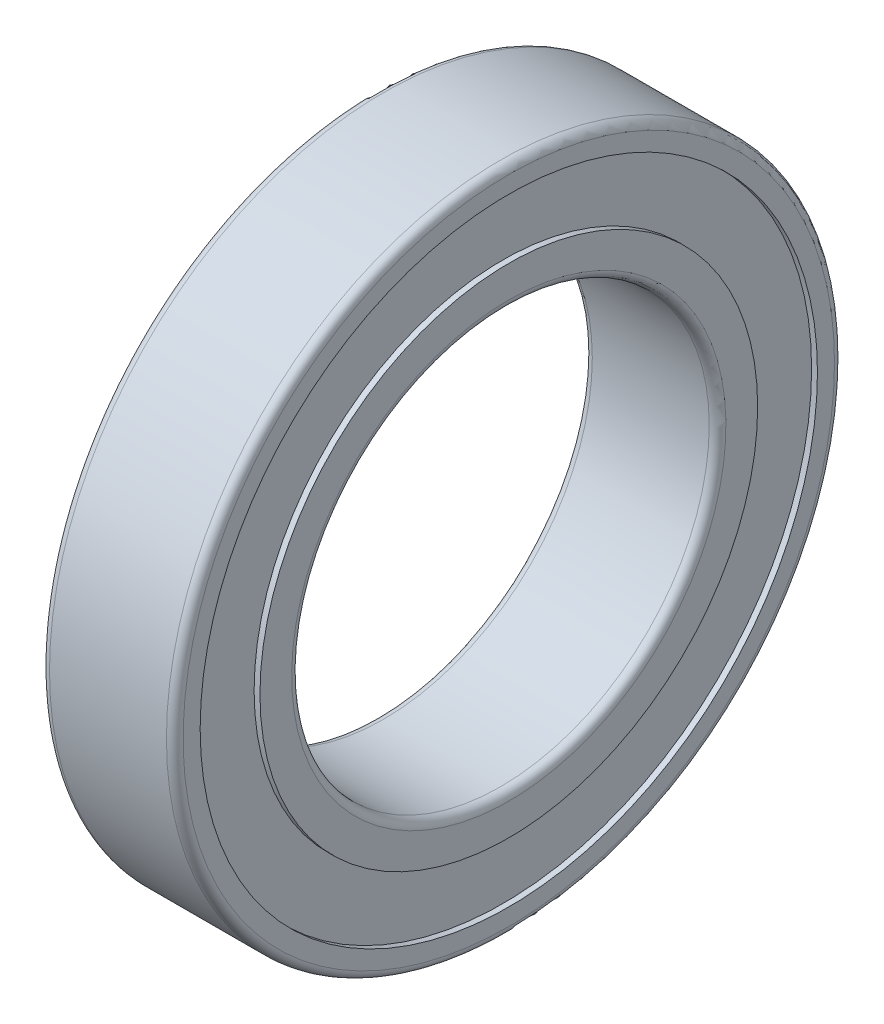
ISO-10303-21;
HEADER;
FILE_DESCRIPTION(('STEP AP214'),'2;1');
FILE_NAME('part.step','',(''),(''),'','','');
FILE_SCHEMA(('AUTOMOTIVE_DESIGN { 1 0 10303 214 1 1 1 1 }'));
ENDSEC;
DATA;
#1=APPLICATION_CONTEXT('core data for automotive mechanical design processes');
#2=APPLICATION_PROTOCOL_DEFINITION('international standard','automotive_design',2000,#1);
#3=PRODUCT_CONTEXT('',#1,'mechanical');
#4=PRODUCT('Part','Part','',(#3));
#5=PRODUCT_RELATED_PRODUCT_CATEGORY('part','',(#4));
#6=PRODUCT_DEFINITION_FORMATION('','',#4);
#7=PRODUCT_DEFINITION_CONTEXT('part definition',#1,'design');
#8=PRODUCT_DEFINITION('design','',#6,#7);
#9=PRODUCT_DEFINITION_SHAPE('','',#8);
#10=(LENGTH_UNIT() NAMED_UNIT(*) SI_UNIT(.MILLI.,.METRE.));
#11=(NAMED_UNIT(*) PLANE_ANGLE_UNIT() SI_UNIT($,.RADIAN.));
#12=(NAMED_UNIT(*) SI_UNIT($,.STERADIAN.) SOLID_ANGLE_UNIT());
#13=UNCERTAINTY_MEASURE_WITH_UNIT(LENGTH_MEASURE(1.E-05),#10,'distance_accuracy_value','');
#14=(GEOMETRIC_REPRESENTATION_CONTEXT(3) GLOBAL_UNCERTAINTY_ASSIGNED_CONTEXT((#13)) GLOBAL_UNIT_ASSIGNED_CONTEXT((#10,
#11,#12)) REPRESENTATION_CONTEXT('',''));
#15=CARTESIAN_POINT('',(0.,0.,0.));
#16=DIRECTION('',(0.,0.,1.));
#17=DIRECTION('',(1.,0.,0.));
#18=AXIS2_PLACEMENT_3D('',#15,#16,#17);
#19=CARTESIAN_POINT('',(16.,0.,0.));
#20=DIRECTION('',(-1.,0.,0.));
#21=DIRECTION('',(0.,0.,1.));
#22=AXIS2_PLACEMENT_3D('',#19,#20,#21);
#23=CYLINDRICAL_SURFACE('',#22,25.);
#24=CARTESIAN_POINT('',(0.999999999999999,0.,0.));
#25=DIRECTION('',(1.,0.,0.));
#26=DIRECTION('',(0.,0.,-1.));
#27=AXIS2_PLACEMENT_3D('',#24,#25,#26);
#28=CIRCLE('',#27,25.);
#29=CARTESIAN_POINT('',(0.999999999999999,0.,-25.));
#30=VERTEX_POINT('',#29);
#31=EDGE_CURVE('E32',#30,#30,#28,.T.);
#32=ORIENTED_EDGE('',*,*,#31,.F.);
#33=EDGE_LOOP('',(#32));
#34=FACE_BOUND('',#33,.T.);
#35=CARTESIAN_POINT('',(15.,0.,0.));
#36=DIRECTION('',(-1.,0.,0.));
#37=DIRECTION('',(0.,-1.,0.));
#38=AXIS2_PLACEMENT_3D('',#35,#36,#37);
#39=CIRCLE('',#38,25.);
#40=CARTESIAN_POINT('',(15.,-25.,0.));
#41=VERTEX_POINT('',#40);
#42=EDGE_CURVE('E35',#41,#41,#39,.T.);
#43=ORIENTED_EDGE('',*,*,#42,.F.);
#44=EDGE_LOOP('',(#43));
#45=FACE_BOUND('',#44,.T.);
#46=ADVANCED_FACE('F16',(#34,#45),#23,.F.);
#47=CARTESIAN_POINT('',(15.,0.,0.));
#48=DIRECTION('',(1.,0.,0.));
#49=DIRECTION('',(0.,1.,0.));
#50=AXIS2_PLACEMENT_3D('',#47,#48,#49);
#51=TOROIDAL_SURFACE('',#50,26.,1.);
#52=ORIENTED_EDGE('',*,*,#42,.T.);
#53=EDGE_LOOP('',(#52));
#54=FACE_BOUND('',#53,.T.);
#55=CARTESIAN_POINT('',(16.,0.,0.));
#56=DIRECTION('',(1.,0.,0.));
#57=DIRECTION('',(0.,1.,0.));
#58=AXIS2_PLACEMENT_3D('',#55,#56,#57);
#59=CIRCLE('',#58,26.);
#60=CARTESIAN_POINT('',(16.,26.,0.));
#61=VERTEX_POINT('',#60);
#62=EDGE_CURVE('E20',#61,#61,#59,.F.);
#63=ORIENTED_EDGE('',*,*,#62,.F.);
#64=EDGE_LOOP('',(#63));
#65=FACE_BOUND('',#64,.T.);
#66=ADVANCED_FACE('F75',(#54,#65),#51,.T.);
#67=CARTESIAN_POINT('',(0.999999999999993,0.,0.));
#68=DIRECTION('',(1.,0.,0.));
#69=DIRECTION('',(0.,0.,-1.));
#70=AXIS2_PLACEMENT_3D('',#67,#68,#69);
#71=TOROIDAL_SURFACE('',#70,26.,0.999999999999999);
#72=ORIENTED_EDGE('',*,*,#31,.T.);
#73=EDGE_LOOP('',(#72));
#74=FACE_BOUND('',#73,.T.);
#75=CARTESIAN_POINT('',(0.,0.,0.));
#76=DIRECTION('',(1.,0.,0.));
#77=DIRECTION('',(0.,0.,-1.));
#78=AXIS2_PLACEMENT_3D('',#75,#76,#77);
#79=CIRCLE('',#78,26.);
#80=CARTESIAN_POINT('',(0.,0.,-26.));
#81=VERTEX_POINT('',#80);
#82=EDGE_CURVE('E66',#81,#81,#79,.T.);
#83=ORIENTED_EDGE('',*,*,#82,.F.);
#84=EDGE_LOOP('',(#83));
#85=FACE_BOUND('',#84,.T.);
#86=ADVANCED_FACE('F77',(#74,#85),#71,.T.);
#87=CARTESIAN_POINT('',(16.,26.,0.));
#88=DIRECTION('',(1.,0.,0.));
#89=DIRECTION('',(0.,0.,-1.));
#90=AXIS2_PLACEMENT_3D('',#87,#88,#89);
#91=PLANE('',#90);
#92=CARTESIAN_POINT('',(16.,0.,0.));
#93=DIRECTION('',(-1.,0.,0.));
#94=DIRECTION('',(0.,0.,1.));
#95=AXIS2_PLACEMENT_3D('',#92,#93,#94);
#96=CIRCLE('',#95,29.8);
#97=CARTESIAN_POINT('',(16.,0.,29.8));
#98=VERTEX_POINT('',#97);
#99=EDGE_CURVE('E64',#98,#98,#96,.T.);
#100=ORIENTED_EDGE('',*,*,#99,.F.);
#101=EDGE_LOOP('',(#100));
#102=FACE_BOUND('',#101,.T.);
#103=ORIENTED_EDGE('',*,*,#62,.T.);
#104=EDGE_LOOP('',(#103));
#105=FACE_BOUND('',#104,.T.);
#106=ADVANCED_FACE('F73',(#102,#105),#91,.T.);
#107=CARTESIAN_POINT('',(0.,29.8,0.));
#108=DIRECTION('',(-1.,0.,0.));
#109=DIRECTION('',(0.,0.,1.));
#110=AXIS2_PLACEMENT_3D('',#107,#108,#109);
#111=PLANE('',#110);
#112=ORIENTED_EDGE('',*,*,#82,.T.);
#113=EDGE_LOOP('',(#112));
#114=FACE_BOUND('',#113,.T.);
#115=CARTESIAN_POINT('',(0.,0.,0.));
#116=DIRECTION('',(-1.,0.,0.));
#117=DIRECTION('',(0.,0.,1.));
#118=AXIS2_PLACEMENT_3D('',#115,#116,#117);
#119=CIRCLE('',#118,29.8);
#120=CARTESIAN_POINT('',(0.,0.,29.8));
#121=VERTEX_POINT('',#120);
#122=EDGE_CURVE('E61',#121,#121,#119,.F.);
#123=ORIENTED_EDGE('',*,*,#122,.F.);
#124=EDGE_LOOP('',(#123));
#125=FACE_BOUND('',#124,.T.);
#126=ADVANCED_FACE('F130',(#114,#125),#111,.T.);
#127=CARTESIAN_POINT('',(16.,0.,0.));
#128=DIRECTION('',(-1.,0.,0.));
#129=DIRECTION('',(0.,0.,1.));
#130=AXIS2_PLACEMENT_3D('',#127,#128,#129);
#131=CYLINDRICAL_SURFACE('',#130,29.8);
#132=ORIENTED_EDGE('',*,*,#99,.T.);
#133=EDGE_LOOP('',(#132));
#134=FACE_BOUND('',#133,.T.);
#135=CARTESIAN_POINT('',(15.3,0.,0.));
#136=DIRECTION('',(-1.,0.,0.));
#137=DIRECTION('',(0.,0.,1.));
#138=AXIS2_PLACEMENT_3D('',#135,#136,#137);
#139=CIRCLE('',#138,29.8);
#140=CARTESIAN_POINT('',(15.3,0.,29.8));
#141=VERTEX_POINT('',#140);
#142=EDGE_CURVE('E58',#141,#141,#139,.T.);
#143=ORIENTED_EDGE('',*,*,#142,.F.);
#144=EDGE_LOOP('',(#143));
#145=FACE_BOUND('',#144,.T.);
#146=ADVANCED_FACE('F126',(#134,#145),#131,.T.);
#147=CARTESIAN_POINT('',(16.,0.,0.));
#148=DIRECTION('',(-1.,0.,0.));
#149=DIRECTION('',(0.,0.,1.));
#150=AXIS2_PLACEMENT_3D('',#147,#148,#149);
#151=CYLINDRICAL_SURFACE('',#150,29.8);
#152=ORIENTED_EDGE('',*,*,#122,.T.);
#153=EDGE_LOOP('',(#152));
#154=FACE_BOUND('',#153,.T.);
#155=CARTESIAN_POINT('',(0.700000000000001,0.,0.));
#156=DIRECTION('',(-1.,0.,0.));
#157=DIRECTION('',(0.,0.,1.));
#158=AXIS2_PLACEMENT_3D('',#155,#156,#157);
#159=CIRCLE('',#158,29.8);
#160=CARTESIAN_POINT('',(0.700000000000001,0.,29.8));
#161=VERTEX_POINT('',#160);
#162=EDGE_CURVE('E55',#161,#161,#159,.F.);
#163=ORIENTED_EDGE('',*,*,#162,.F.);
#164=EDGE_LOOP('',(#163));
#165=FACE_BOUND('',#164,.T.);
#166=ADVANCED_FACE('F122',(#154,#165),#151,.T.);
#167=CARTESIAN_POINT('',(15.3,29.8,0.));
#168=DIRECTION('',(1.,0.,0.));
#169=DIRECTION('',(0.,0.,-1.));
#170=AXIS2_PLACEMENT_3D('',#167,#168,#169);
#171=PLANE('',#170);
#172=CARTESIAN_POINT('',(15.3,0.,0.));
#173=DIRECTION('',(-1.,0.,0.));
#174=DIRECTION('',(0.,0.,1.));
#175=AXIS2_PLACEMENT_3D('',#172,#173,#174);
#176=CIRCLE('',#175,36.96);
#177=CARTESIAN_POINT('',(15.3,0.,36.96));
#178=VERTEX_POINT('',#177);
#179=EDGE_CURVE('E52',#178,#178,#176,.F.);
#180=ORIENTED_EDGE('',*,*,#179,.T.);
#181=EDGE_LOOP('',(#180));
#182=FACE_BOUND('',#181,.T.);
#183=ORIENTED_EDGE('',*,*,#142,.T.);
#184=EDGE_LOOP('',(#183));
#185=FACE_BOUND('',#184,.T.);
#186=ADVANCED_FACE('F118',(#182,#185),#171,.T.);
#187=CARTESIAN_POINT('',(0.7,36.96,0.));
#188=DIRECTION('',(-1.,0.,0.));
#189=DIRECTION('',(0.,0.,1.));
#190=AXIS2_PLACEMENT_3D('',#187,#188,#189);
#191=PLANE('',#190);
#192=ORIENTED_EDGE('',*,*,#162,.T.);
#193=EDGE_LOOP('',(#192));
#194=FACE_BOUND('',#193,.T.);
#195=CARTESIAN_POINT('',(0.700000000000001,0.,0.));
#196=DIRECTION('',(-1.,0.,0.));
#197=DIRECTION('',(0.,0.,1.));
#198=AXIS2_PLACEMENT_3D('',#195,#196,#197);
#199=CIRCLE('',#198,36.96);
#200=CARTESIAN_POINT('',(0.700000000000001,0.,36.96));
#201=VERTEX_POINT('',#200);
#202=EDGE_CURVE('E49',#201,#201,#199,.T.);
#203=ORIENTED_EDGE('',*,*,#202,.T.);
#204=EDGE_LOOP('',(#203));
#205=FACE_BOUND('',#204,.T.);
#206=ADVANCED_FACE('F114',(#194,#205),#191,.T.);
#207=CARTESIAN_POINT('',(16.,0.,0.));
#208=DIRECTION('',(-1.,0.,0.));
#209=DIRECTION('',(0.,0.,1.));
#210=AXIS2_PLACEMENT_3D('',#207,#208,#209);
#211=CYLINDRICAL_SURFACE('',#210,36.96);
#212=ORIENTED_EDGE('',*,*,#179,.F.);
#213=EDGE_LOOP('',(#212));
#214=FACE_BOUND('',#213,.T.);
#215=CARTESIAN_POINT('',(16.,0.,0.));
#216=DIRECTION('',(-1.,0.,0.));
#217=DIRECTION('',(0.,0.,1.));
#218=AXIS2_PLACEMENT_3D('',#215,#216,#217);
#219=CIRCLE('',#218,36.96);
#220=CARTESIAN_POINT('',(16.,0.,36.96));
#221=VERTEX_POINT('',#220);
#222=EDGE_CURVE('E46',#221,#221,#219,.T.);
#223=ORIENTED_EDGE('',*,*,#222,.F.);
#224=EDGE_LOOP('',(#223));
#225=FACE_BOUND('',#224,.T.);
#226=ADVANCED_FACE('F110',(#214,#225),#211,.F.);
#227=CARTESIAN_POINT('',(16.,0.,0.));
#228=DIRECTION('',(-1.,0.,0.));
#229=DIRECTION('',(0.,0.,1.));
#230=AXIS2_PLACEMENT_3D('',#227,#228,#229);
#231=CYLINDRICAL_SURFACE('',#230,36.96);
#232=ORIENTED_EDGE('',*,*,#202,.F.);
#233=EDGE_LOOP('',(#232));
#234=FACE_BOUND('',#233,.T.);
#235=CARTESIAN_POINT('',(0.,0.,0.));
#236=DIRECTION('',(-1.,0.,0.));
#237=DIRECTION('',(0.,0.,1.));
#238=AXIS2_PLACEMENT_3D('',#235,#236,#237);
#239=CIRCLE('',#238,36.96);
#240=CARTESIAN_POINT('',(0.,0.,36.96));
#241=VERTEX_POINT('',#240);
#242=EDGE_CURVE('E43',#241,#241,#239,.F.);
#243=ORIENTED_EDGE('',*,*,#242,.F.);
#244=EDGE_LOOP('',(#243));
#245=FACE_BOUND('',#244,.T.);
#246=ADVANCED_FACE('F106',(#234,#245),#231,.F.);
#247=CARTESIAN_POINT('',(16.,36.96,0.));
#248=DIRECTION('',(1.,0.,0.));
#249=DIRECTION('',(0.,0.,-1.));
#250=AXIS2_PLACEMENT_3D('',#247,#248,#249);
#251=PLANE('',#250);
#252=CARTESIAN_POINT('',(16.,0.,0.));
#253=DIRECTION('',(1.,0.,0.));
#254=DIRECTION('',(0.,0.,-1.));
#255=AXIS2_PLACEMENT_3D('',#252,#253,#254);
#256=CIRCLE('',#255,39.);
#257=CARTESIAN_POINT('',(16.,0.,-39.));
#258=VERTEX_POINT('',#257);
#259=EDGE_CURVE('E40',#258,#258,#256,.F.);
#260=ORIENTED_EDGE('',*,*,#259,.F.);
#261=EDGE_LOOP('',(#260));
#262=FACE_BOUND('',#261,.T.);
#263=ORIENTED_EDGE('',*,*,#222,.T.);
#264=EDGE_LOOP('',(#263));
#265=FACE_BOUND('',#264,.T.);
#266=ADVANCED_FACE('F102',(#262,#265),#251,.T.);
#267=CARTESIAN_POINT('',(0.,39.,0.));
#268=DIRECTION('',(-1.,0.,0.));
#269=DIRECTION('',(0.,0.,1.));
#270=AXIS2_PLACEMENT_3D('',#267,#268,#269);
#271=PLANE('',#270);
#272=ORIENTED_EDGE('',*,*,#242,.T.);
#273=EDGE_LOOP('',(#272));
#274=FACE_BOUND('',#273,.T.);
#275=CARTESIAN_POINT('',(0.,0.,0.));
#276=DIRECTION('',(1.,0.,0.));
#277=DIRECTION('',(0.,0.,-1.));
#278=AXIS2_PLACEMENT_3D('',#275,#276,#277);
#279=CIRCLE('',#278,39.);
#280=CARTESIAN_POINT('',(0.,0.,-39.));
#281=VERTEX_POINT('',#280);
#282=EDGE_CURVE('E29',#281,#281,#279,.T.);
#283=ORIENTED_EDGE('',*,*,#282,.F.);
#284=EDGE_LOOP('',(#283));
#285=FACE_BOUND('',#284,.T.);
#286=ADVANCED_FACE('F99',(#274,#285),#271,.T.);
#287=CARTESIAN_POINT('',(15.,0.,0.));
#288=DIRECTION('',(1.,0.,0.));
#289=DIRECTION('',(0.,0.,-1.));
#290=AXIS2_PLACEMENT_3D('',#287,#288,#289);
#291=TOROIDAL_SURFACE('',#290,39.,1.);
#292=ORIENTED_EDGE('',*,*,#259,.T.);
#293=EDGE_LOOP('',(#292));
#294=FACE_BOUND('',#293,.T.);
#295=CARTESIAN_POINT('',(15.,0.,0.));
#296=DIRECTION('',(-1.,0.,0.));
#297=DIRECTION('',(0.,0.,1.));
#298=AXIS2_PLACEMENT_3D('',#295,#296,#297);
#299=CIRCLE('',#298,40.);
#300=CARTESIAN_POINT('',(15.,0.,40.));
#301=VERTEX_POINT('',#300);
#302=EDGE_CURVE('E24',#301,#301,#299,.T.);
#303=ORIENTED_EDGE('',*,*,#302,.F.);
#304=EDGE_LOOP('',(#303));
#305=FACE_BOUND('',#304,.T.);
#306=ADVANCED_FACE('F95',(#294,#305),#291,.T.);
#307=CARTESIAN_POINT('',(1.00000000000001,0.,0.));
#308=DIRECTION('',(1.,0.,0.));
#309=DIRECTION('',(0.,0.,-1.));
#310=AXIS2_PLACEMENT_3D('',#307,#308,#309);
#311=TOROIDAL_SURFACE('',#310,39.,1.);
#312=CARTESIAN_POINT('',(1.,0.,0.));
#313=DIRECTION('',(-1.,0.,0.));
#314=DIRECTION('',(0.,0.,1.));
#315=AXIS2_PLACEMENT_3D('',#312,#313,#314);
#316=CIRCLE('',#315,40.);
#317=CARTESIAN_POINT('',(1.,0.,40.));
#318=VERTEX_POINT('',#317);
#319=EDGE_CURVE('E10',#318,#318,#316,.F.);
#320=ORIENTED_EDGE('',*,*,#319,.F.);
#321=EDGE_LOOP('',(#320));
#322=FACE_BOUND('',#321,.T.);
#323=ORIENTED_EDGE('',*,*,#282,.T.);
#324=EDGE_LOOP('',(#323));
#325=FACE_BOUND('',#324,.T.);
#326=ADVANCED_FACE('F18',(#322,#325),#311,.T.);
#327=CARTESIAN_POINT('',(16.,0.,0.));
#328=DIRECTION('',(-1.,0.,0.));
#329=DIRECTION('',(0.,0.,1.));
#330=AXIS2_PLACEMENT_3D('',#327,#328,#329);
#331=CYLINDRICAL_SURFACE('',#330,40.);
#332=ORIENTED_EDGE('',*,*,#319,.T.);
#333=EDGE_LOOP('',(#332));
#334=FACE_BOUND('',#333,.T.);
#335=ORIENTED_EDGE('',*,*,#302,.T.);
#336=EDGE_LOOP('',(#335));
#337=FACE_BOUND('',#336,.T.);
#338=ADVANCED_FACE('F89',(#334,#337),#331,.T.);
#339=CLOSED_SHELL('',(#46,#66,#86,#106,#126,#146,#166,#186,#206,#226,#246,#266,#286,#306,#326,#338));
#340=MANIFOLD_SOLID_BREP('B1',#339);
#341=ADVANCED_BREP_SHAPE_REPRESENTATION('',(#18,#340),#14);
#342=SHAPE_DEFINITION_REPRESENTATION(#9,#341);
ENDSEC;
END-ISO-10303-21;
